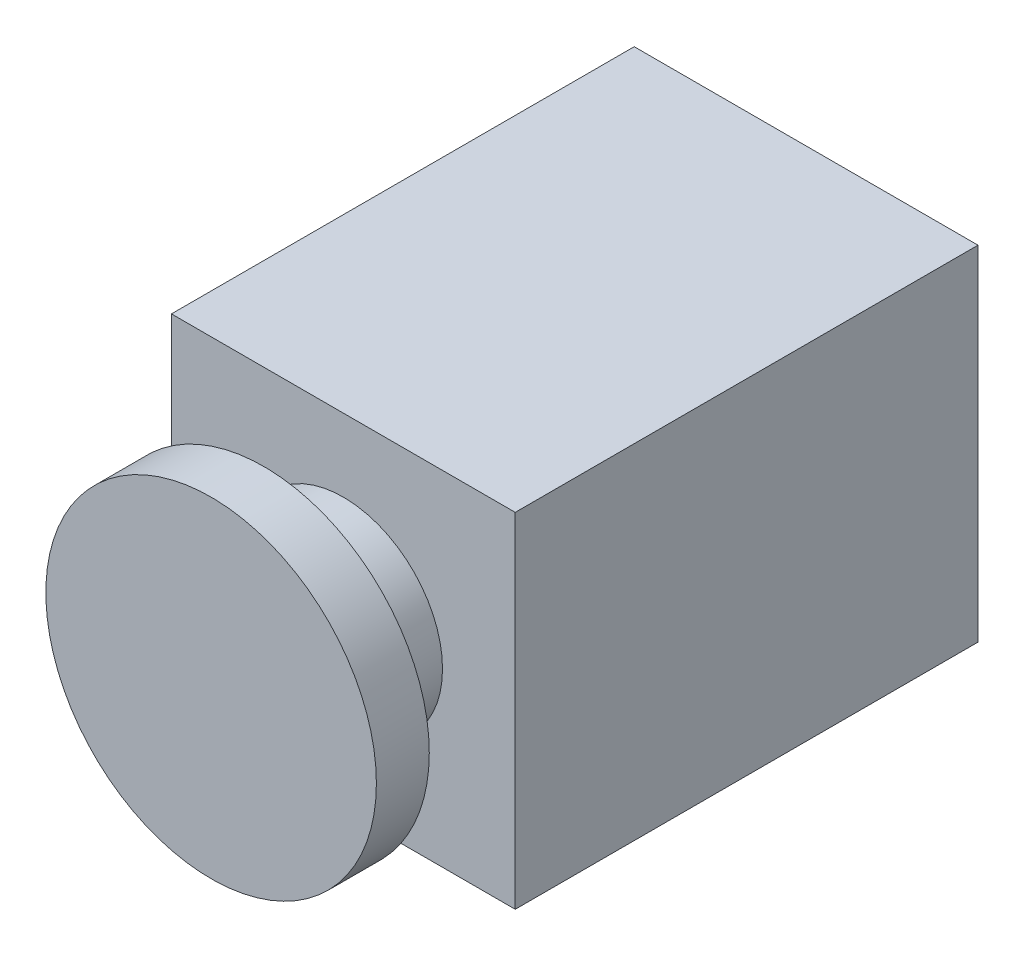
ISO-10303-21;
HEADER;
FILE_DESCRIPTION(('STEP AP214'),'2;1');
FILE_NAME('part.step','',(''),(''),'','','');
FILE_SCHEMA(('AUTOMOTIVE_DESIGN { 1 0 10303 214 1 1 1 1 }'));
ENDSEC;
DATA;
#1=APPLICATION_CONTEXT('core data for automotive mechanical design processes');
#2=APPLICATION_PROTOCOL_DEFINITION('international standard','automotive_design',2000,#1);
#3=PRODUCT_CONTEXT('',#1,'mechanical');
#4=PRODUCT('Part','Part','',(#3));
#5=PRODUCT_RELATED_PRODUCT_CATEGORY('part','',(#4));
#6=PRODUCT_DEFINITION_FORMATION('','',#4);
#7=PRODUCT_DEFINITION_CONTEXT('part definition',#1,'design');
#8=PRODUCT_DEFINITION('design','',#6,#7);
#9=PRODUCT_DEFINITION_SHAPE('','',#8);
#10=(LENGTH_UNIT() NAMED_UNIT(*) SI_UNIT(.MILLI.,.METRE.));
#11=(NAMED_UNIT(*) PLANE_ANGLE_UNIT() SI_UNIT($,.RADIAN.));
#12=(NAMED_UNIT(*) SI_UNIT($,.STERADIAN.) SOLID_ANGLE_UNIT());
#13=UNCERTAINTY_MEASURE_WITH_UNIT(LENGTH_MEASURE(1.E-05),#10,'distance_accuracy_value','');
#14=(GEOMETRIC_REPRESENTATION_CONTEXT(3) GLOBAL_UNCERTAINTY_ASSIGNED_CONTEXT((#13)) GLOBAL_UNIT_ASSIGNED_CONTEXT((#10,
#11,#12)) REPRESENTATION_CONTEXT('',''));
#15=CARTESIAN_POINT('',(0.,0.,0.));
#16=DIRECTION('',(0.,0.,1.));
#17=DIRECTION('',(1.,0.,0.));
#18=AXIS2_PLACEMENT_3D('',#15,#16,#17);
#19=CARTESIAN_POINT('',(0.,0.,90.));
#20=DIRECTION('',(0.,0.,-1.));
#21=DIRECTION('',(-1.,0.,0.));
#22=AXIS2_PLACEMENT_3D('',#19,#20,#21);
#23=CYLINDRICAL_SURFACE('',#22,15.);
#24=CARTESIAN_POINT('',(0.,0.,70.));
#25=DIRECTION('',(0.,0.,1.));
#26=DIRECTION('',(1.,0.,0.));
#27=AXIS2_PLACEMENT_3D('',#24,#25,#26);
#28=CIRCLE('',#27,15.);
#29=CARTESIAN_POINT('',(15.,0.,70.));
#30=VERTEX_POINT('',#29);
#31=EDGE_CURVE('E48',#30,#30,#28,.T.);
#32=ORIENTED_EDGE('',*,*,#31,.T.);
#33=EDGE_LOOP('',(#32));
#34=FACE_BOUND('',#33,.T.);
#35=CARTESIAN_POINT('',(0.,0.,82.));
#36=DIRECTION('',(0.,0.,1.));
#37=DIRECTION('',(1.,0.,0.));
#38=AXIS2_PLACEMENT_3D('',#35,#36,#37);
#39=CIRCLE('',#38,15.);
#40=CARTESIAN_POINT('',(15.,0.,82.));
#41=VERTEX_POINT('',#40);
#42=EDGE_CURVE('E11',#41,#41,#39,.T.);
#43=ORIENTED_EDGE('',*,*,#42,.F.);
#44=EDGE_LOOP('',(#43));
#45=FACE_BOUND('',#44,.T.);
#46=ADVANCED_FACE('F39',(#34,#45),#23,.T.);
#47=CARTESIAN_POINT('',(26.,-26.,70.));
#48=DIRECTION('',(-1.,0.,0.));
#49=DIRECTION('',(0.,0.,1.));
#50=AXIS2_PLACEMENT_3D('',#47,#48,#49);
#51=PLANE('',#50);
#52=DIRECTION('',(0.,1.,0.));
#53=VECTOR('',#52,1.);
#54=CARTESIAN_POINT('',(26.,-26.,0.));
#55=LINE('',#54,#53);
#56=CARTESIAN_POINT('',(26.,-26.,0.));
#57=VERTEX_POINT('',#56);
#58=CARTESIAN_POINT('',(26.,26.,0.));
#59=VERTEX_POINT('',#58);
#60=EDGE_CURVE('E107',#57,#59,#55,.T.);
#61=ORIENTED_EDGE('',*,*,#60,.T.);
#62=DIRECTION('',(0.,0.,-1.));
#63=VECTOR('',#62,1.);
#64=CARTESIAN_POINT('',(26.,26.,70.));
#65=LINE('',#64,#63);
#66=CARTESIAN_POINT('',(26.,26.,70.));
#67=VERTEX_POINT('',#66);
#68=EDGE_CURVE('E98',#67,#59,#65,.T.);
#69=ORIENTED_EDGE('',*,*,#68,.F.);
#70=DIRECTION('',(0.,1.,0.));
#71=VECTOR('',#70,1.);
#72=CARTESIAN_POINT('',(26.,-26.,70.));
#73=LINE('',#72,#71);
#74=CARTESIAN_POINT('',(26.,-26.,70.));
#75=VERTEX_POINT('',#74);
#76=EDGE_CURVE('E92',#75,#67,#73,.T.);
#77=ORIENTED_EDGE('',*,*,#76,.F.);
#78=DIRECTION('',(0.,0.,-1.));
#79=VECTOR('',#78,1.);
#80=CARTESIAN_POINT('',(26.,-26.,70.));
#81=LINE('',#80,#79);
#82=EDGE_CURVE('E103',#75,#57,#81,.T.);
#83=ORIENTED_EDGE('',*,*,#82,.T.);
#84=EDGE_LOOP('',(#61,#69,#77,#83));
#85=FACE_BOUND('',#84,.T.);
#86=ADVANCED_FACE('F41',(#85),#51,.F.);
#87=CARTESIAN_POINT('',(-26.,26.,70.));
#88=DIRECTION('',(0.,-1.,0.));
#89=DIRECTION('',(0.,0.,-1.));
#90=AXIS2_PLACEMENT_3D('',#87,#88,#89);
#91=PLANE('',#90);
#92=DIRECTION('',(-1.,0.,0.));
#93=VECTOR('',#92,1.);
#94=CARTESIAN_POINT('',(-26.,26.,0.));
#95=LINE('',#94,#93);
#96=CARTESIAN_POINT('',(-26.,26.,0.));
#97=VERTEX_POINT('',#96);
#98=EDGE_CURVE('E97',#59,#97,#95,.T.);
#99=ORIENTED_EDGE('',*,*,#98,.T.);
#100=DIRECTION('',(0.,0.,-1.));
#101=VECTOR('',#100,1.);
#102=CARTESIAN_POINT('',(-26.,26.,70.));
#103=LINE('',#102,#101);
#104=CARTESIAN_POINT('',(-26.,26.,70.));
#105=VERTEX_POINT('',#104);
#106=EDGE_CURVE('E95',#105,#97,#103,.T.);
#107=ORIENTED_EDGE('',*,*,#106,.F.);
#108=DIRECTION('',(-1.,0.,0.));
#109=VECTOR('',#108,1.);
#110=CARTESIAN_POINT('',(-26.,26.,70.));
#111=LINE('',#110,#109);
#112=EDGE_CURVE('E87',#67,#105,#111,.T.);
#113=ORIENTED_EDGE('',*,*,#112,.F.);
#114=ORIENTED_EDGE('',*,*,#68,.T.);
#115=EDGE_LOOP('',(#99,#107,#113,#114));
#116=FACE_BOUND('',#115,.T.);
#117=ADVANCED_FACE('F96',(#116),#91,.F.);
#118=CARTESIAN_POINT('',(-26.,-26.,70.));
#119=DIRECTION('',(1.,0.,0.));
#120=DIRECTION('',(0.,0.,-1.));
#121=AXIS2_PLACEMENT_3D('',#118,#119,#120);
#122=PLANE('',#121);
#123=DIRECTION('',(0.,-1.,0.));
#124=VECTOR('',#123,1.);
#125=CARTESIAN_POINT('',(-26.,-26.,0.));
#126=LINE('',#125,#124);
#127=CARTESIAN_POINT('',(-26.,-26.,0.));
#128=VERTEX_POINT('',#127);
#129=EDGE_CURVE('E73',#97,#128,#126,.T.);
#130=ORIENTED_EDGE('',*,*,#129,.T.);
#131=DIRECTION('',(0.,0.,-1.));
#132=VECTOR('',#131,1.);
#133=CARTESIAN_POINT('',(-26.,-26.,70.));
#134=LINE('',#133,#132);
#135=CARTESIAN_POINT('',(-26.,-26.,70.));
#136=VERTEX_POINT('',#135);
#137=EDGE_CURVE('E99',#136,#128,#134,.T.);
#138=ORIENTED_EDGE('',*,*,#137,.F.);
#139=DIRECTION('',(0.,-1.,0.));
#140=VECTOR('',#139,1.);
#141=CARTESIAN_POINT('',(-26.,-26.,70.));
#142=LINE('',#141,#140);
#143=EDGE_CURVE('E90',#105,#136,#142,.T.);
#144=ORIENTED_EDGE('',*,*,#143,.F.);
#145=ORIENTED_EDGE('',*,*,#106,.T.);
#146=EDGE_LOOP('',(#130,#138,#144,#145));
#147=FACE_BOUND('',#146,.T.);
#148=ADVANCED_FACE('F101',(#147),#122,.F.);
#149=CARTESIAN_POINT('',(-26.,-26.,70.));
#150=DIRECTION('',(0.,1.,0.));
#151=DIRECTION('',(0.,0.,1.));
#152=AXIS2_PLACEMENT_3D('',#149,#150,#151);
#153=PLANE('',#152);
#154=CARTESIAN_POINT('',(-1.5,-26.,7.00000000000001));
#155=DIRECTION('',(0.,-1.,0.));
#156=DIRECTION('',(0.,0.,-1.));
#157=AXIS2_PLACEMENT_3D('',#154,#155,#156);
#158=CIRCLE('',#157,1.);
#159=CARTESIAN_POINT('',(-1.5,-26.,6.));
#160=VERTEX_POINT('',#159);
#161=EDGE_CURVE('E138',#160,#160,#158,.T.);
#162=ORIENTED_EDGE('',*,*,#161,.F.);
#163=EDGE_LOOP('',(#162));
#164=FACE_BOUND('',#163,.T.);
#165=CARTESIAN_POINT('',(-1.5,-26.,28.5));
#166=DIRECTION('',(0.,-1.,0.));
#167=DIRECTION('',(0.,0.,-1.));
#168=AXIS2_PLACEMENT_3D('',#165,#166,#167);
#169=CIRCLE('',#168,1.);
#170=CARTESIAN_POINT('',(-1.5,-26.,27.5));
#171=VERTEX_POINT('',#170);
#172=EDGE_CURVE('E145',#171,#171,#169,.T.);
#173=ORIENTED_EDGE('',*,*,#172,.F.);
#174=EDGE_LOOP('',(#173));
#175=FACE_BOUND('',#174,.T.);
#176=CARTESIAN_POINT('',(-1.5,-26.,62.));
#177=DIRECTION('',(0.,-1.,0.));
#178=DIRECTION('',(0.,0.,-1.));
#179=AXIS2_PLACEMENT_3D('',#176,#177,#178);
#180=CIRCLE('',#179,1.);
#181=CARTESIAN_POINT('',(-1.5,-26.,61.));
#182=VERTEX_POINT('',#181);
#183=EDGE_CURVE('E126',#182,#182,#180,.T.);
#184=ORIENTED_EDGE('',*,*,#183,.F.);
#185=EDGE_LOOP('',(#184));
#186=FACE_BOUND('',#185,.T.);
#187=CARTESIAN_POINT('',(-16.5,-26.,28.5));
#188=DIRECTION('',(0.,-1.,0.));
#189=DIRECTION('',(0.,0.,-1.));
#190=AXIS2_PLACEMENT_3D('',#187,#188,#189);
#191=CIRCLE('',#190,1.);
#192=CARTESIAN_POINT('',(-16.5,-26.,27.5));
#193=VERTEX_POINT('',#192);
#194=EDGE_CURVE('E133',#193,#193,#191,.T.);
#195=ORIENTED_EDGE('',*,*,#194,.F.);
#196=EDGE_LOOP('',(#195));
#197=FACE_BOUND('',#196,.T.);
#198=CARTESIAN_POINT('',(-16.5,-26.,7.00000000000001));
#199=DIRECTION('',(0.,-1.,0.));
#200=DIRECTION('',(0.,0.,-1.));
#201=AXIS2_PLACEMENT_3D('',#198,#199,#200);
#202=CIRCLE('',#201,1.);
#203=CARTESIAN_POINT('',(-16.5,-26.,6.00000000000001));
#204=VERTEX_POINT('',#203);
#205=EDGE_CURVE('E150',#204,#204,#202,.T.);
#206=ORIENTED_EDGE('',*,*,#205,.F.);
#207=EDGE_LOOP('',(#206));
#208=FACE_BOUND('',#207,.T.);
#209=CARTESIAN_POINT('',(-16.5,-26.,62.));
#210=DIRECTION('',(0.,-1.,0.));
#211=DIRECTION('',(0.,0.,-1.));
#212=AXIS2_PLACEMENT_3D('',#209,#210,#211);
#213=CIRCLE('',#212,1.);
#214=CARTESIAN_POINT('',(-16.5,-26.,61.));
#215=VERTEX_POINT('',#214);
#216=EDGE_CURVE('E120',#215,#215,#213,.T.);
#217=ORIENTED_EDGE('',*,*,#216,.F.);
#218=EDGE_LOOP('',(#217));
#219=FACE_BOUND('',#218,.T.);
#220=DIRECTION('',(1.,0.,0.));
#221=VECTOR('',#220,1.);
#222=CARTESIAN_POINT('',(-26.,-26.,0.));
#223=LINE('',#222,#221);
#224=EDGE_CURVE('E79',#128,#57,#223,.T.);
#225=ORIENTED_EDGE('',*,*,#224,.T.);
#226=ORIENTED_EDGE('',*,*,#82,.F.);
#227=DIRECTION('',(1.,0.,0.));
#228=VECTOR('',#227,1.);
#229=CARTESIAN_POINT('',(-26.,-26.,70.));
#230=LINE('',#229,#228);
#231=EDGE_CURVE('E56',#136,#75,#230,.T.);
#232=ORIENTED_EDGE('',*,*,#231,.F.);
#233=ORIENTED_EDGE('',*,*,#137,.T.);
#234=EDGE_LOOP('',(#225,#226,#232,#233));
#235=FACE_BOUND('',#234,.T.);
#236=ADVANCED_FACE('F190',(#164,#175,#186,#197,#208,#219,#235),#153,.F.);
#237=CARTESIAN_POINT('',(0.,0.,70.));
#238=DIRECTION('',(0.,0.,-1.));
#239=DIRECTION('',(-1.,0.,0.));
#240=AXIS2_PLACEMENT_3D('',#237,#238,#239);
#241=PLANE('',#240);
#242=ORIENTED_EDGE('',*,*,#31,.F.);
#243=EDGE_LOOP('',(#242));
#244=FACE_BOUND('',#243,.T.);
#245=ORIENTED_EDGE('',*,*,#76,.T.);
#246=ORIENTED_EDGE('',*,*,#112,.T.);
#247=ORIENTED_EDGE('',*,*,#143,.T.);
#248=ORIENTED_EDGE('',*,*,#231,.T.);
#249=EDGE_LOOP('',(#245,#246,#247,#248));
#250=FACE_BOUND('',#249,.T.);
#251=ADVANCED_FACE('F88',(#244,#250),#241,.F.);
#252=CARTESIAN_POINT('',(0.,0.,0.));
#253=DIRECTION('',(0.,0.,-1.));
#254=DIRECTION('',(-1.,0.,0.));
#255=AXIS2_PLACEMENT_3D('',#252,#253,#254);
#256=PLANE('',#255);
#257=ORIENTED_EDGE('',*,*,#60,.F.);
#258=ORIENTED_EDGE('',*,*,#224,.F.);
#259=ORIENTED_EDGE('',*,*,#129,.F.);
#260=ORIENTED_EDGE('',*,*,#98,.F.);
#261=EDGE_LOOP('',(#257,#258,#259,#260));
#262=FACE_BOUND('',#261,.T.);
#263=ADVANCED_FACE('F189',(#262),#256,.T.);
#264=CARTESIAN_POINT('',(-16.5,-21.,62.));
#265=DIRECTION('',(0.,-1.,0.));
#266=DIRECTION('',(0.,0.,-1.));
#267=AXIS2_PLACEMENT_3D('',#264,#265,#266);
#268=CYLINDRICAL_SURFACE('',#267,1.);
#269=CARTESIAN_POINT('',(-16.5,-21.,62.));
#270=DIRECTION('',(0.,-1.,0.));
#271=DIRECTION('',(0.,0.,-1.));
#272=AXIS2_PLACEMENT_3D('',#269,#270,#271);
#273=CIRCLE('',#272,1.);
#274=CARTESIAN_POINT('',(-16.5,-21.,61.));
#275=VERTEX_POINT('',#274);
#276=EDGE_CURVE('E110',#275,#275,#273,.T.);
#277=ORIENTED_EDGE('',*,*,#276,.F.);
#278=EDGE_LOOP('',(#277));
#279=FACE_BOUND('',#278,.T.);
#280=ORIENTED_EDGE('',*,*,#216,.T.);
#281=EDGE_LOOP('',(#280));
#282=FACE_BOUND('',#281,.T.);
#283=ADVANCED_FACE('F194',(#279,#282),#268,.F.);
#284=CARTESIAN_POINT('',(-16.5,-21.,62.));
#285=DIRECTION('',(0.,-1.,0.));
#286=DIRECTION('',(0.,0.,-1.));
#287=AXIS2_PLACEMENT_3D('',#284,#285,#286);
#288=PLANE('',#287);
#289=ORIENTED_EDGE('',*,*,#276,.T.);
#290=EDGE_LOOP('',(#289));
#291=FACE_BOUND('',#290,.T.);
#292=ADVANCED_FACE('F227',(#291),#288,.T.);
#293=CARTESIAN_POINT('',(-16.5,-21.,7.00000000000001));
#294=DIRECTION('',(0.,-1.,0.));
#295=DIRECTION('',(0.,0.,-1.));
#296=AXIS2_PLACEMENT_3D('',#293,#294,#295);
#297=CYLINDRICAL_SURFACE('',#296,1.);
#298=CARTESIAN_POINT('',(-16.5,-21.,7.00000000000001));
#299=DIRECTION('',(0.,-1.,0.));
#300=DIRECTION('',(0.,0.,-1.));
#301=AXIS2_PLACEMENT_3D('',#298,#299,#300);
#302=CIRCLE('',#301,1.);
#303=CARTESIAN_POINT('',(-16.5,-21.,6.00000000000001));
#304=VERTEX_POINT('',#303);
#305=EDGE_CURVE('E142',#304,#304,#302,.T.);
#306=ORIENTED_EDGE('',*,*,#305,.F.);
#307=EDGE_LOOP('',(#306));
#308=FACE_BOUND('',#307,.T.);
#309=ORIENTED_EDGE('',*,*,#205,.T.);
#310=EDGE_LOOP('',(#309));
#311=FACE_BOUND('',#310,.T.);
#312=ADVANCED_FACE('F234',(#308,#311),#297,.F.);
#313=CARTESIAN_POINT('',(-16.5,-21.,7.00000000000001));
#314=DIRECTION('',(0.,-1.,0.));
#315=DIRECTION('',(0.,0.,-1.));
#316=AXIS2_PLACEMENT_3D('',#313,#314,#315);
#317=PLANE('',#316);
#318=ORIENTED_EDGE('',*,*,#305,.T.);
#319=EDGE_LOOP('',(#318));
#320=FACE_BOUND('',#319,.T.);
#321=ADVANCED_FACE('F242',(#320),#317,.T.);
#322=CARTESIAN_POINT('',(-16.5,-21.,28.5));
#323=DIRECTION('',(0.,-1.,0.));
#324=DIRECTION('',(0.,0.,-1.));
#325=AXIS2_PLACEMENT_3D('',#322,#323,#324);
#326=CYLINDRICAL_SURFACE('',#325,1.);
#327=CARTESIAN_POINT('',(-16.5,-21.,28.5));
#328=DIRECTION('',(0.,-1.,0.));
#329=DIRECTION('',(0.,0.,-1.));
#330=AXIS2_PLACEMENT_3D('',#327,#328,#329);
#331=CIRCLE('',#330,1.);
#332=CARTESIAN_POINT('',(-16.5,-21.,27.5));
#333=VERTEX_POINT('',#332);
#334=EDGE_CURVE('E123',#333,#333,#331,.T.);
#335=ORIENTED_EDGE('',*,*,#334,.F.);
#336=EDGE_LOOP('',(#335));
#337=FACE_BOUND('',#336,.T.);
#338=ORIENTED_EDGE('',*,*,#194,.T.);
#339=EDGE_LOOP('',(#338));
#340=FACE_BOUND('',#339,.T.);
#341=ADVANCED_FACE('F250',(#337,#340),#326,.F.);
#342=CARTESIAN_POINT('',(-16.5,-21.,28.5));
#343=DIRECTION('',(0.,-1.,0.));
#344=DIRECTION('',(0.,0.,-1.));
#345=AXIS2_PLACEMENT_3D('',#342,#343,#344);
#346=PLANE('',#345);
#347=ORIENTED_EDGE('',*,*,#334,.T.);
#348=EDGE_LOOP('',(#347));
#349=FACE_BOUND('',#348,.T.);
#350=ADVANCED_FACE('F258',(#349),#346,.T.);
#351=CARTESIAN_POINT('',(-1.5,-21.,62.));
#352=DIRECTION('',(0.,-1.,0.));
#353=DIRECTION('',(0.,0.,-1.));
#354=AXIS2_PLACEMENT_3D('',#351,#352,#353);
#355=CYLINDRICAL_SURFACE('',#354,1.);
#356=CARTESIAN_POINT('',(-1.5,-21.,62.));
#357=DIRECTION('',(0.,-1.,0.));
#358=DIRECTION('',(0.,0.,-1.));
#359=AXIS2_PLACEMENT_3D('',#356,#357,#358);
#360=CIRCLE('',#359,1.);
#361=CARTESIAN_POINT('',(-1.5,-21.,61.));
#362=VERTEX_POINT('',#361);
#363=EDGE_CURVE('E129',#362,#362,#360,.T.);
#364=ORIENTED_EDGE('',*,*,#363,.F.);
#365=EDGE_LOOP('',(#364));
#366=FACE_BOUND('',#365,.T.);
#367=ORIENTED_EDGE('',*,*,#183,.T.);
#368=EDGE_LOOP('',(#367));
#369=FACE_BOUND('',#368,.T.);
#370=ADVANCED_FACE('F266',(#366,#369),#355,.F.);
#371=CARTESIAN_POINT('',(-1.5,-21.,62.));
#372=DIRECTION('',(0.,-1.,0.));
#373=DIRECTION('',(0.,0.,-1.));
#374=AXIS2_PLACEMENT_3D('',#371,#372,#373);
#375=PLANE('',#374);
#376=ORIENTED_EDGE('',*,*,#363,.T.);
#377=EDGE_LOOP('',(#376));
#378=FACE_BOUND('',#377,.T.);
#379=ADVANCED_FACE('F274',(#378),#375,.T.);
#380=CARTESIAN_POINT('',(-1.5,-21.,28.5));
#381=DIRECTION('',(0.,-1.,0.));
#382=DIRECTION('',(0.,0.,-1.));
#383=AXIS2_PLACEMENT_3D('',#380,#381,#382);
#384=CYLINDRICAL_SURFACE('',#383,1.);
#385=CARTESIAN_POINT('',(-1.5,-21.,28.5));
#386=DIRECTION('',(0.,-1.,0.));
#387=DIRECTION('',(0.,0.,-1.));
#388=AXIS2_PLACEMENT_3D('',#385,#386,#387);
#389=CIRCLE('',#388,1.);
#390=CARTESIAN_POINT('',(-1.5,-21.,27.5));
#391=VERTEX_POINT('',#390);
#392=EDGE_CURVE('E130',#391,#391,#389,.T.);
#393=ORIENTED_EDGE('',*,*,#392,.F.);
#394=EDGE_LOOP('',(#393));
#395=FACE_BOUND('',#394,.T.);
#396=ORIENTED_EDGE('',*,*,#172,.T.);
#397=EDGE_LOOP('',(#396));
#398=FACE_BOUND('',#397,.T.);
#399=ADVANCED_FACE('F282',(#395,#398),#384,.F.);
#400=CARTESIAN_POINT('',(-1.5,-21.,28.5));
#401=DIRECTION('',(0.,-1.,0.));
#402=DIRECTION('',(0.,0.,-1.));
#403=AXIS2_PLACEMENT_3D('',#400,#401,#402);
#404=PLANE('',#403);
#405=ORIENTED_EDGE('',*,*,#392,.T.);
#406=EDGE_LOOP('',(#405));
#407=FACE_BOUND('',#406,.T.);
#408=ADVANCED_FACE('F290',(#407),#404,.T.);
#409=CARTESIAN_POINT('',(-1.5,-21.,7.00000000000001));
#410=DIRECTION('',(0.,-1.,0.));
#411=DIRECTION('',(0.,0.,-1.));
#412=AXIS2_PLACEMENT_3D('',#409,#410,#411);
#413=CYLINDRICAL_SURFACE('',#412,1.);
#414=CARTESIAN_POINT('',(-1.5,-21.,7.00000000000001));
#415=DIRECTION('',(0.,-1.,0.));
#416=DIRECTION('',(0.,0.,-1.));
#417=AXIS2_PLACEMENT_3D('',#414,#415,#416);
#418=CIRCLE('',#417,1.);
#419=CARTESIAN_POINT('',(-1.5,-21.,6.));
#420=VERTEX_POINT('',#419);
#421=EDGE_CURVE('E141',#420,#420,#418,.T.);
#422=ORIENTED_EDGE('',*,*,#421,.F.);
#423=EDGE_LOOP('',(#422));
#424=FACE_BOUND('',#423,.T.);
#425=ORIENTED_EDGE('',*,*,#161,.T.);
#426=EDGE_LOOP('',(#425));
#427=FACE_BOUND('',#426,.T.);
#428=ADVANCED_FACE('F298',(#424,#427),#413,.F.);
#429=CARTESIAN_POINT('',(-1.5,-21.,7.00000000000001));
#430=DIRECTION('',(0.,-1.,0.));
#431=DIRECTION('',(0.,0.,-1.));
#432=AXIS2_PLACEMENT_3D('',#429,#430,#431);
#433=PLANE('',#432);
#434=ORIENTED_EDGE('',*,*,#421,.T.);
#435=EDGE_LOOP('',(#434));
#436=FACE_BOUND('',#435,.T.);
#437=ADVANCED_FACE('F176',(#436),#433,.T.);
#438=CARTESIAN_POINT('',(0.,0.,82.));
#439=DIRECTION('',(0.,0.,1.));
#440=DIRECTION('',(1.,0.,0.));
#441=AXIS2_PLACEMENT_3D('',#438,#439,#440);
#442=CYLINDRICAL_SURFACE('',#441,25.);
#443=CARTESIAN_POINT('',(0.,0.,82.));
#444=DIRECTION('',(0.,0.,1.));
#445=DIRECTION('',(1.,0.,0.));
#446=AXIS2_PLACEMENT_3D('',#443,#444,#445);
#447=CIRCLE('',#446,25.);
#448=CARTESIAN_POINT('',(25.,0.,82.));
#449=VERTEX_POINT('',#448);
#450=EDGE_CURVE('E153',#449,#449,#447,.T.);
#451=ORIENTED_EDGE('',*,*,#450,.T.);
#452=EDGE_LOOP('',(#451));
#453=FACE_BOUND('',#452,.T.);
#454=CARTESIAN_POINT('',(0.,0.,90.));
#455=DIRECTION('',(0.,0.,1.));
#456=DIRECTION('',(1.,0.,0.));
#457=AXIS2_PLACEMENT_3D('',#454,#455,#456);
#458=CIRCLE('',#457,25.);
#459=CARTESIAN_POINT('',(25.,0.,90.));
#460=VERTEX_POINT('',#459);
#461=EDGE_CURVE('E156',#460,#460,#458,.T.);
#462=ORIENTED_EDGE('',*,*,#461,.F.);
#463=EDGE_LOOP('',(#462));
#464=FACE_BOUND('',#463,.T.);
#465=ADVANCED_FACE('F162',(#453,#464),#442,.T.);
#466=CARTESIAN_POINT('',(0.,0.,82.));
#467=DIRECTION('',(0.,0.,1.));
#468=DIRECTION('',(1.,0.,0.));
#469=AXIS2_PLACEMENT_3D('',#466,#467,#468);
#470=PLANE('',#469);
#471=ORIENTED_EDGE('',*,*,#42,.T.);
#472=EDGE_LOOP('',(#471));
#473=FACE_BOUND('',#472,.T.);
#474=ORIENTED_EDGE('',*,*,#450,.F.);
#475=EDGE_LOOP('',(#474));
#476=FACE_BOUND('',#475,.T.);
#477=ADVANCED_FACE('F165',(#473,#476),#470,.F.);
#478=CARTESIAN_POINT('',(0.,0.,90.));
#479=DIRECTION('',(0.,0.,1.));
#480=DIRECTION('',(1.,0.,0.));
#481=AXIS2_PLACEMENT_3D('',#478,#479,#480);
#482=PLANE('',#481);
#483=ORIENTED_EDGE('',*,*,#461,.T.);
#484=EDGE_LOOP('',(#483));
#485=FACE_BOUND('',#484,.T.);
#486=ADVANCED_FACE('F167',(#485),#482,.T.);
#487=CLOSED_SHELL('',(#46,#86,#117,#148,#236,#251,#263,#283,#292,#312,#321,#341,#350,#370,#379,
#399,#408,#428,#437,#465,#477,#486));
#488=MANIFOLD_SOLID_BREP('B2',#487);
#489=ADVANCED_BREP_SHAPE_REPRESENTATION('',(#18,#488),#14);
#490=SHAPE_DEFINITION_REPRESENTATION(#9,#489);
ENDSEC;
END-ISO-10303-21;
